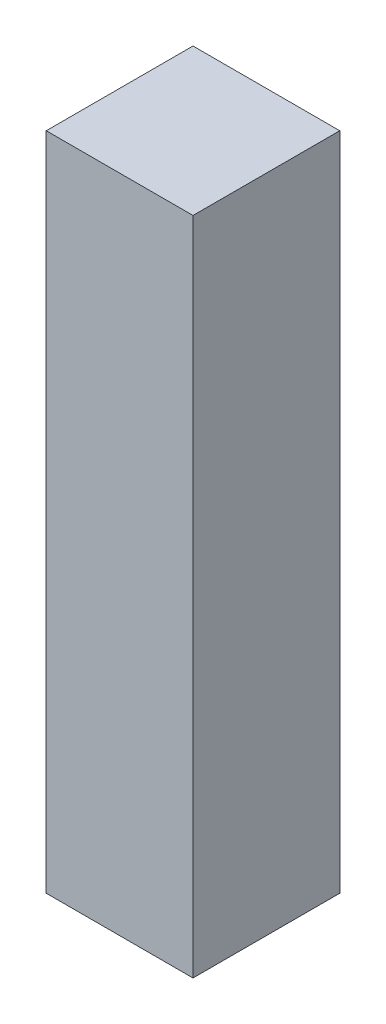
ISO-10303-21;
HEADER;
FILE_DESCRIPTION(('STEP AP214'),'2;1');
FILE_NAME('part.step','',(''),(''),'','','');
FILE_SCHEMA(('AUTOMOTIVE_DESIGN { 1 0 10303 214 1 1 1 1 }'));
ENDSEC;
DATA;
#1=APPLICATION_CONTEXT('core data for automotive mechanical design processes');
#2=APPLICATION_PROTOCOL_DEFINITION('international standard','automotive_design',2000,#1);
#3=PRODUCT_CONTEXT('',#1,'mechanical');
#4=PRODUCT('Part','Part','',(#3));
#5=PRODUCT_RELATED_PRODUCT_CATEGORY('part','',(#4));
#6=PRODUCT_DEFINITION_FORMATION('','',#4);
#7=PRODUCT_DEFINITION_CONTEXT('part definition',#1,'design');
#8=PRODUCT_DEFINITION('design','',#6,#7);
#9=PRODUCT_DEFINITION_SHAPE('','',#8);
#10=(LENGTH_UNIT() NAMED_UNIT(*) SI_UNIT(.MILLI.,.METRE.));
#11=(NAMED_UNIT(*) PLANE_ANGLE_UNIT() SI_UNIT($,.RADIAN.));
#12=(NAMED_UNIT(*) SI_UNIT($,.STERADIAN.) SOLID_ANGLE_UNIT());
#13=UNCERTAINTY_MEASURE_WITH_UNIT(LENGTH_MEASURE(1.E-05),#10,'distance_accuracy_value','');
#14=(GEOMETRIC_REPRESENTATION_CONTEXT(3) GLOBAL_UNCERTAINTY_ASSIGNED_CONTEXT((#13)) GLOBAL_UNIT_ASSIGNED_CONTEXT((#10,
#11,#12)) REPRESENTATION_CONTEXT('',''));
#15=CARTESIAN_POINT('',(0.,0.,0.));
#16=DIRECTION('',(0.,0.,1.));
#17=DIRECTION('',(1.,0.,0.));
#18=AXIS2_PLACEMENT_3D('',#15,#16,#17);
#19=CARTESIAN_POINT('',(1.5875,-7.14375,3.175));
#20=DIRECTION('',(-1.,0.,0.));
#21=DIRECTION('',(0.,0.,1.));
#22=AXIS2_PLACEMENT_3D('',#19,#20,#21);
#23=PLANE('',#22);
#24=DIRECTION('',(0.,1.,0.));
#25=VECTOR('',#24,1.);
#26=CARTESIAN_POINT('',(1.5875,-7.14375,0.));
#27=LINE('',#26,#25);
#28=CARTESIAN_POINT('',(1.5875,-7.14375,0.));
#29=VERTEX_POINT('',#28);
#30=CARTESIAN_POINT('',(1.5875,7.14375,0.));
#31=VERTEX_POINT('',#30);
#32=EDGE_CURVE('E112',#29,#31,#27,.T.);
#33=ORIENTED_EDGE('',*,*,#32,.T.);
#34=DIRECTION('',(0.,0.,-1.));
#35=VECTOR('',#34,1.);
#36=CARTESIAN_POINT('',(1.5875,7.14375,3.175));
#37=LINE('',#36,#35);
#38=CARTESIAN_POINT('',(1.5875,7.14375,3.175));
#39=VERTEX_POINT('',#38);
#40=EDGE_CURVE('E11',#39,#31,#37,.T.);
#41=ORIENTED_EDGE('',*,*,#40,.F.);
#42=DIRECTION('',(0.,1.,0.));
#43=VECTOR('',#42,1.);
#44=CARTESIAN_POINT('',(1.5875,-7.14375,3.175));
#45=LINE('',#44,#43);
#46=CARTESIAN_POINT('',(1.5875,-7.14375,3.175));
#47=VERTEX_POINT('',#46);
#48=EDGE_CURVE('E96',#47,#39,#45,.T.);
#49=ORIENTED_EDGE('',*,*,#48,.F.);
#50=DIRECTION('',(0.,0.,-1.));
#51=VECTOR('',#50,1.);
#52=CARTESIAN_POINT('',(1.5875,-7.14375,3.175));
#53=LINE('',#52,#51);
#54=EDGE_CURVE('E108',#47,#29,#53,.T.);
#55=ORIENTED_EDGE('',*,*,#54,.T.);
#56=EDGE_LOOP('',(#33,#41,#49,#55));
#57=FACE_BOUND('',#56,.T.);
#58=ADVANCED_FACE('F44',(#57),#23,.F.);
#59=CARTESIAN_POINT('',(-1.5875,7.14375,3.175));
#60=DIRECTION('',(0.,-1.,0.));
#61=DIRECTION('',(0.,0.,-1.));
#62=AXIS2_PLACEMENT_3D('',#59,#60,#61);
#63=PLANE('',#62);
#64=DIRECTION('',(-1.,0.,0.));
#65=VECTOR('',#64,1.);
#66=CARTESIAN_POINT('',(-1.5875,7.14375,0.));
#67=LINE('',#66,#65);
#68=CARTESIAN_POINT('',(-1.5875,7.14375,0.));
#69=VERTEX_POINT('',#68);
#70=EDGE_CURVE('E101',#31,#69,#67,.T.);
#71=ORIENTED_EDGE('',*,*,#70,.T.);
#72=DIRECTION('',(0.,0.,-1.));
#73=VECTOR('',#72,1.);
#74=CARTESIAN_POINT('',(-1.5875,7.14375,3.175));
#75=LINE('',#74,#73);
#76=CARTESIAN_POINT('',(-1.5875,7.14375,3.175));
#77=VERTEX_POINT('',#76);
#78=EDGE_CURVE('E53',#77,#69,#75,.T.);
#79=ORIENTED_EDGE('',*,*,#78,.F.);
#80=DIRECTION('',(-1.,0.,0.));
#81=VECTOR('',#80,1.);
#82=CARTESIAN_POINT('',(-1.5875,7.14375,3.175));
#83=LINE('',#82,#81);
#84=EDGE_CURVE('E91',#39,#77,#83,.T.);
#85=ORIENTED_EDGE('',*,*,#84,.F.);
#86=ORIENTED_EDGE('',*,*,#40,.T.);
#87=EDGE_LOOP('',(#71,#79,#85,#86));
#88=FACE_BOUND('',#87,.T.);
#89=ADVANCED_FACE('F100',(#88),#63,.F.);
#90=CARTESIAN_POINT('',(-1.5875,-7.14375,3.175));
#91=DIRECTION('',(1.,0.,0.));
#92=DIRECTION('',(0.,0.,-1.));
#93=AXIS2_PLACEMENT_3D('',#90,#91,#92);
#94=PLANE('',#93);
#95=DIRECTION('',(0.,-1.,0.));
#96=VECTOR('',#95,1.);
#97=CARTESIAN_POINT('',(-1.5875,-7.14375,0.));
#98=LINE('',#97,#96);
#99=CARTESIAN_POINT('',(-1.5875,-7.14375,0.));
#100=VERTEX_POINT('',#99);
#101=EDGE_CURVE('E78',#69,#100,#98,.T.);
#102=ORIENTED_EDGE('',*,*,#101,.T.);
#103=DIRECTION('',(0.,0.,-1.));
#104=VECTOR('',#103,1.);
#105=CARTESIAN_POINT('',(-1.5875,-7.14375,3.175));
#106=LINE('',#105,#104);
#107=CARTESIAN_POINT('',(-1.5875,-7.14375,3.175));
#108=VERTEX_POINT('',#107);
#109=EDGE_CURVE('E103',#108,#100,#106,.T.);
#110=ORIENTED_EDGE('',*,*,#109,.F.);
#111=DIRECTION('',(0.,-1.,0.));
#112=VECTOR('',#111,1.);
#113=CARTESIAN_POINT('',(-1.5875,-7.14375,3.175));
#114=LINE('',#113,#112);
#115=EDGE_CURVE('E94',#77,#108,#114,.T.);
#116=ORIENTED_EDGE('',*,*,#115,.F.);
#117=ORIENTED_EDGE('',*,*,#78,.T.);
#118=EDGE_LOOP('',(#102,#110,#116,#117));
#119=FACE_BOUND('',#118,.T.);
#120=ADVANCED_FACE('F104',(#119),#94,.F.);
#121=CARTESIAN_POINT('',(-1.5875,-7.14375,3.175));
#122=DIRECTION('',(0.,1.,0.));
#123=DIRECTION('',(0.,0.,1.));
#124=AXIS2_PLACEMENT_3D('',#121,#122,#123);
#125=PLANE('',#124);
#126=DIRECTION('',(1.,0.,0.));
#127=VECTOR('',#126,1.);
#128=CARTESIAN_POINT('',(-1.5875,-7.14375,0.));
#129=LINE('',#128,#127);
#130=EDGE_CURVE('E84',#100,#29,#129,.T.);
#131=ORIENTED_EDGE('',*,*,#130,.T.);
#132=ORIENTED_EDGE('',*,*,#54,.F.);
#133=DIRECTION('',(1.,0.,0.));
#134=VECTOR('',#133,1.);
#135=CARTESIAN_POINT('',(-1.5875,-7.14375,3.175));
#136=LINE('',#135,#134);
#137=EDGE_CURVE('E61',#108,#47,#136,.T.);
#138=ORIENTED_EDGE('',*,*,#137,.F.);
#139=ORIENTED_EDGE('',*,*,#109,.T.);
#140=EDGE_LOOP('',(#131,#132,#138,#139));
#141=FACE_BOUND('',#140,.T.);
#142=ADVANCED_FACE('F125',(#141),#125,.F.);
#143=CARTESIAN_POINT('',(0.,0.,3.175));
#144=DIRECTION('',(0.,0.,-1.));
#145=DIRECTION('',(-1.,0.,0.));
#146=AXIS2_PLACEMENT_3D('',#143,#144,#145);
#147=PLANE('',#146);
#148=ORIENTED_EDGE('',*,*,#48,.T.);
#149=ORIENTED_EDGE('',*,*,#84,.T.);
#150=ORIENTED_EDGE('',*,*,#115,.T.);
#151=ORIENTED_EDGE('',*,*,#137,.T.);
#152=EDGE_LOOP('',(#148,#149,#150,#151));
#153=FACE_BOUND('',#152,.T.);
#154=ADVANCED_FACE('F92',(#153),#147,.F.);
#155=CARTESIAN_POINT('',(0.,0.,0.));
#156=DIRECTION('',(0.,0.,-1.));
#157=DIRECTION('',(-1.,0.,0.));
#158=AXIS2_PLACEMENT_3D('',#155,#156,#157);
#159=PLANE('',#158);
#160=ORIENTED_EDGE('',*,*,#32,.F.);
#161=ORIENTED_EDGE('',*,*,#130,.F.);
#162=ORIENTED_EDGE('',*,*,#101,.F.);
#163=ORIENTED_EDGE('',*,*,#70,.F.);
#164=EDGE_LOOP('',(#160,#161,#162,#163));
#165=FACE_BOUND('',#164,.T.);
#166=ADVANCED_FACE('F128',(#165),#159,.T.);
#167=CLOSED_SHELL('',(#58,#89,#120,#142,#154,#166));
#168=MANIFOLD_SOLID_BREP('B2',#167);
#169=ADVANCED_BREP_SHAPE_REPRESENTATION('',(#18,#168),#14);
#170=SHAPE_DEFINITION_REPRESENTATION(#9,#169);
ENDSEC;
END-ISO-10303-21;
